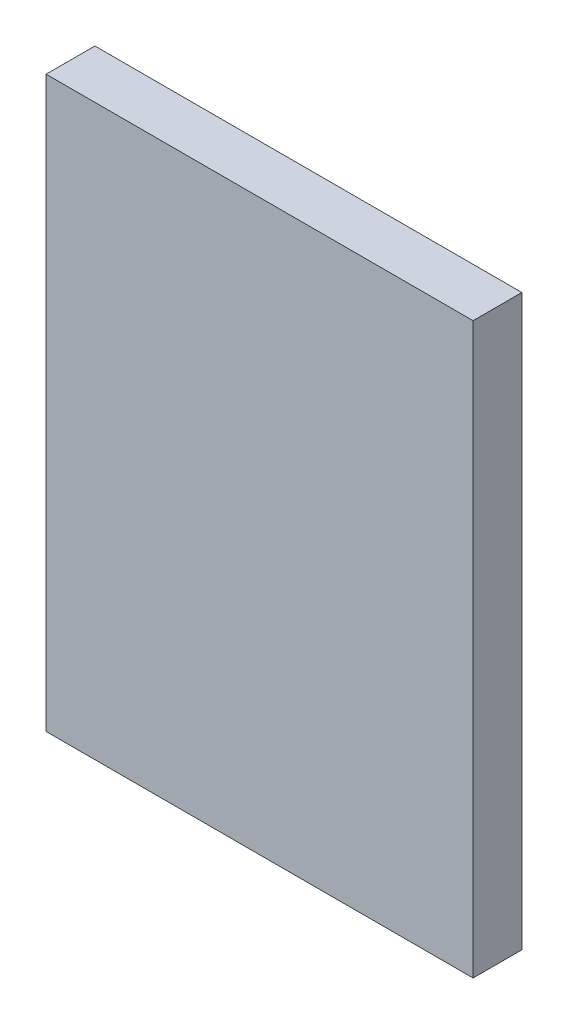
ISO-10303-21;
HEADER;
FILE_DESCRIPTION(('STEP AP214'),'2;1');
FILE_NAME('part.step','',(''),(''),'','','');
FILE_SCHEMA(('AUTOMOTIVE_DESIGN { 1 0 10303 214 1 1 1 1 }'));
ENDSEC;
DATA;
#1=APPLICATION_CONTEXT('core data for automotive mechanical design processes');
#2=APPLICATION_PROTOCOL_DEFINITION('international standard','automotive_design',2000,#1);
#3=PRODUCT_CONTEXT('',#1,'mechanical');
#4=PRODUCT('Part','Part','',(#3));
#5=PRODUCT_RELATED_PRODUCT_CATEGORY('part','',(#4));
#6=PRODUCT_DEFINITION_FORMATION('','',#4);
#7=PRODUCT_DEFINITION_CONTEXT('part definition',#1,'design');
#8=PRODUCT_DEFINITION('design','',#6,#7);
#9=PRODUCT_DEFINITION_SHAPE('','',#8);
#10=(LENGTH_UNIT() NAMED_UNIT(*) SI_UNIT(.MILLI.,.METRE.));
#11=(NAMED_UNIT(*) PLANE_ANGLE_UNIT() SI_UNIT($,.RADIAN.));
#12=(NAMED_UNIT(*) SI_UNIT($,.STERADIAN.) SOLID_ANGLE_UNIT());
#13=UNCERTAINTY_MEASURE_WITH_UNIT(LENGTH_MEASURE(1.E-05),#10,'distance_accuracy_value','');
#14=(GEOMETRIC_REPRESENTATION_CONTEXT(3) GLOBAL_UNCERTAINTY_ASSIGNED_CONTEXT((#13)) GLOBAL_UNIT_ASSIGNED_CONTEXT((#10,
#11,#12)) REPRESENTATION_CONTEXT('',''));
#15=CARTESIAN_POINT('',(0.,0.,0.));
#16=DIRECTION('',(0.,0.,1.));
#17=DIRECTION('',(1.,0.,0.));
#18=AXIS2_PLACEMENT_3D('',#15,#16,#17);
#19=CARTESIAN_POINT('',(6.4052,1.651,0.76487));
#20=DIRECTION('',(0.,0.,-1.));
#21=DIRECTION('',(-1.,0.,0.));
#22=AXIS2_PLACEMENT_3D('',#19,#20,#21);
#23=PLANE('',#22);
#24=DIRECTION('',(1.,0.,0.));
#25=VECTOR('',#24,1.);
#26=CARTESIAN_POINT('',(6.2552,1.851,0.76487));
#27=LINE('',#26,#25);
#28=CARTESIAN_POINT('',(6.2552,1.851,0.76487));
#29=VERTEX_POINT('',#28);
#30=CARTESIAN_POINT('',(6.5552,1.851,0.76487));
#31=VERTEX_POINT('',#30);
#32=EDGE_CURVE('E55',#29,#31,#27,.T.);
#33=ORIENTED_EDGE('',*,*,#32,.T.);
#34=DIRECTION('',(0.,1.,0.));
#35=VECTOR('',#34,1.);
#36=CARTESIAN_POINT('',(6.5552,1.851,0.76487));
#37=LINE('',#36,#35);
#38=CARTESIAN_POINT('',(6.5552,1.451,0.76487));
#39=VERTEX_POINT('',#38);
#40=EDGE_CURVE('E57',#31,#39,#37,.F.);
#41=ORIENTED_EDGE('',*,*,#40,.T.);
#42=DIRECTION('',(1.,0.,0.));
#43=VECTOR('',#42,1.);
#44=CARTESIAN_POINT('',(6.5552,1.451,0.76487));
#45=LINE('',#44,#43);
#46=CARTESIAN_POINT('',(6.2552,1.451,0.76487));
#47=VERTEX_POINT('',#46);
#48=EDGE_CURVE('E20',#39,#47,#45,.F.);
#49=ORIENTED_EDGE('',*,*,#48,.T.);
#50=DIRECTION('',(0.,1.,0.));
#51=VECTOR('',#50,1.);
#52=CARTESIAN_POINT('',(6.2552,1.451,0.76487));
#53=LINE('',#52,#51);
#54=EDGE_CURVE('E80',#47,#29,#53,.T.);
#55=ORIENTED_EDGE('',*,*,#54,.T.);
#56=EDGE_LOOP('',(#33,#41,#49,#55));
#57=FACE_BOUND('',#56,.T.);
#58=ADVANCED_FACE('F17',(#57),#23,.T.);
#59=CARTESIAN_POINT('',(6.5552,1.451,0.76487));
#60=DIRECTION('',(0.,1.,0.));
#61=DIRECTION('',(0.,0.,1.));
#62=AXIS2_PLACEMENT_3D('',#59,#60,#61);
#63=PLANE('',#62);
#64=DIRECTION('',(0.,0.,-1.));
#65=VECTOR('',#64,1.);
#66=CARTESIAN_POINT('',(6.2552,1.451,0.76487));
#67=LINE('',#66,#65);
#68=CARTESIAN_POINT('',(6.2552,1.451,0.79916));
#69=VERTEX_POINT('',#68);
#70=EDGE_CURVE('E68',#69,#47,#67,.T.);
#71=ORIENTED_EDGE('',*,*,#70,.T.);
#72=ORIENTED_EDGE('',*,*,#48,.F.);
#73=DIRECTION('',(0.,0.,1.));
#74=VECTOR('',#73,1.);
#75=CARTESIAN_POINT('',(6.5552,1.451,0.76487));
#76=LINE('',#75,#74);
#77=CARTESIAN_POINT('',(6.5552,1.451,0.79916));
#78=VERTEX_POINT('',#77);
#79=EDGE_CURVE('E63',#39,#78,#76,.T.);
#80=ORIENTED_EDGE('',*,*,#79,.T.);
#81=DIRECTION('',(1.,0.,0.));
#82=VECTOR('',#81,1.);
#83=CARTESIAN_POINT('',(6.4052,1.451,0.79916));
#84=LINE('',#83,#82);
#85=EDGE_CURVE('E83',#69,#78,#84,.T.);
#86=ORIENTED_EDGE('',*,*,#85,.F.);
#87=EDGE_LOOP('',(#71,#72,#80,#86));
#88=FACE_BOUND('',#87,.T.);
#89=ADVANCED_FACE('F65',(#88),#63,.F.);
#90=CARTESIAN_POINT('',(6.5552,1.851,0.76487));
#91=DIRECTION('',(-1.,0.,0.));
#92=DIRECTION('',(0.,0.,1.));
#93=AXIS2_PLACEMENT_3D('',#90,#91,#92);
#94=PLANE('',#93);
#95=ORIENTED_EDGE('',*,*,#79,.F.);
#96=ORIENTED_EDGE('',*,*,#40,.F.);
#97=DIRECTION('',(0.,0.,-1.));
#98=VECTOR('',#97,1.);
#99=CARTESIAN_POINT('',(6.5552,1.851,0.76487));
#100=LINE('',#99,#98);
#101=CARTESIAN_POINT('',(6.5552,1.851,0.79916));
#102=VERTEX_POINT('',#101);
#103=EDGE_CURVE('E75',#31,#102,#100,.F.);
#104=ORIENTED_EDGE('',*,*,#103,.T.);
#105=DIRECTION('',(0.,-1.,0.));
#106=VECTOR('',#105,1.);
#107=CARTESIAN_POINT('',(6.5552,1.651,0.79916));
#108=LINE('',#107,#106);
#109=EDGE_CURVE('E72',#78,#102,#108,.F.);
#110=ORIENTED_EDGE('',*,*,#109,.F.);
#111=EDGE_LOOP('',(#95,#96,#104,#110));
#112=FACE_BOUND('',#111,.T.);
#113=ADVANCED_FACE('F70',(#112),#94,.F.);
#114=CARTESIAN_POINT('',(6.2552,1.851,0.76487));
#115=DIRECTION('',(0.,-1.,0.));
#116=DIRECTION('',(0.,0.,-1.));
#117=AXIS2_PLACEMENT_3D('',#114,#115,#116);
#118=PLANE('',#117);
#119=ORIENTED_EDGE('',*,*,#103,.F.);
#120=ORIENTED_EDGE('',*,*,#32,.F.);
#121=DIRECTION('',(0.,0.,-1.));
#122=VECTOR('',#121,1.);
#123=CARTESIAN_POINT('',(6.2552,1.851,0.76487));
#124=LINE('',#123,#122);
#125=CARTESIAN_POINT('',(6.2552,1.851,0.79916));
#126=VERTEX_POINT('',#125);
#127=EDGE_CURVE('E35',#29,#126,#124,.F.);
#128=ORIENTED_EDGE('',*,*,#127,.T.);
#129=DIRECTION('',(1.,0.,0.));
#130=VECTOR('',#129,1.);
#131=CARTESIAN_POINT('',(6.4052,1.851,0.79916));
#132=LINE('',#131,#130);
#133=EDGE_CURVE('E26',#102,#126,#132,.F.);
#134=ORIENTED_EDGE('',*,*,#133,.F.);
#135=EDGE_LOOP('',(#119,#120,#128,#134));
#136=FACE_BOUND('',#135,.T.);
#137=ADVANCED_FACE('F89',(#136),#118,.F.);
#138=CARTESIAN_POINT('',(6.2552,1.451,0.76487));
#139=DIRECTION('',(1.,0.,0.));
#140=DIRECTION('',(0.,0.,-1.));
#141=AXIS2_PLACEMENT_3D('',#138,#139,#140);
#142=PLANE('',#141);
#143=ORIENTED_EDGE('',*,*,#127,.F.);
#144=ORIENTED_EDGE('',*,*,#54,.F.);
#145=ORIENTED_EDGE('',*,*,#70,.F.);
#146=DIRECTION('',(0.,-1.,0.));
#147=VECTOR('',#146,1.);
#148=CARTESIAN_POINT('',(6.2552,1.651,0.79916));
#149=LINE('',#148,#147);
#150=EDGE_CURVE('E11',#126,#69,#149,.T.);
#151=ORIENTED_EDGE('',*,*,#150,.F.);
#152=EDGE_LOOP('',(#143,#144,#145,#151));
#153=FACE_BOUND('',#152,.T.);
#154=ADVANCED_FACE('F91',(#153),#142,.F.);
#155=CARTESIAN_POINT('',(6.4052,1.651,0.79916));
#156=DIRECTION('',(0.,0.,1.));
#157=DIRECTION('',(0.,-1.,0.));
#158=AXIS2_PLACEMENT_3D('',#155,#156,#157);
#159=PLANE('',#158);
#160=ORIENTED_EDGE('',*,*,#133,.T.);
#161=ORIENTED_EDGE('',*,*,#150,.T.);
#162=ORIENTED_EDGE('',*,*,#85,.T.);
#163=ORIENTED_EDGE('',*,*,#109,.T.);
#164=EDGE_LOOP('',(#160,#161,#162,#163));
#165=FACE_BOUND('',#164,.T.);
#166=ADVANCED_FACE('F88',(#165),#159,.T.);
#167=CLOSED_SHELL('',(#58,#89,#113,#137,#154,#166));
#168=MANIFOLD_SOLID_BREP('B1',#167);
#169=ADVANCED_BREP_SHAPE_REPRESENTATION('',(#18,#168),#14);
#170=SHAPE_DEFINITION_REPRESENTATION(#9,#169);
ENDSEC;
END-ISO-10303-21;
